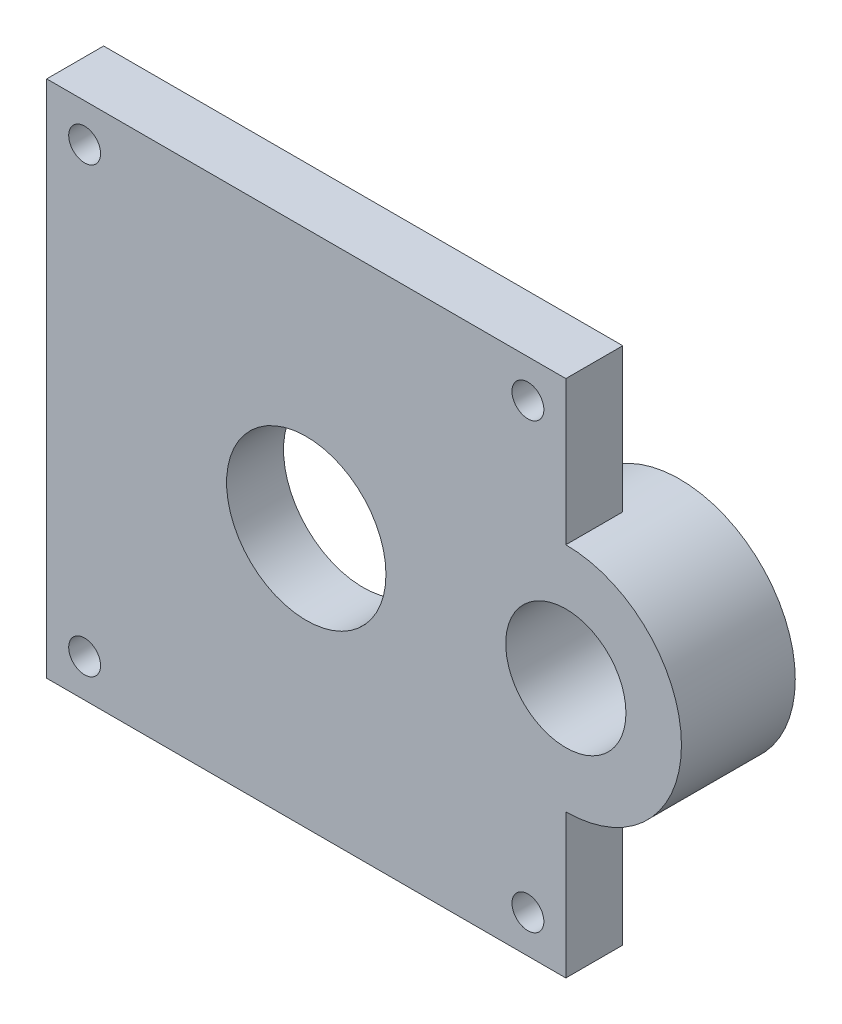
ISO-10303-21;
HEADER;
FILE_DESCRIPTION(('STEP AP214'),'2;1');
FILE_NAME('part.step','',(''),(''),'','','');
FILE_SCHEMA(('AUTOMOTIVE_DESIGN { 1 0 10303 214 1 1 1 1 }'));
ENDSEC;
DATA;
#1=APPLICATION_CONTEXT('core data for automotive mechanical design processes');
#2=APPLICATION_PROTOCOL_DEFINITION('international standard','automotive_design',2000,#1);
#3=PRODUCT_CONTEXT('',#1,'mechanical');
#4=PRODUCT('Part','Part','',(#3));
#5=PRODUCT_RELATED_PRODUCT_CATEGORY('part','',(#4));
#6=PRODUCT_DEFINITION_FORMATION('','',#4);
#7=PRODUCT_DEFINITION_CONTEXT('part definition',#1,'design');
#8=PRODUCT_DEFINITION('design','',#6,#7);
#9=PRODUCT_DEFINITION_SHAPE('','',#8);
#10=(LENGTH_UNIT() NAMED_UNIT(*) SI_UNIT(.MILLI.,.METRE.));
#11=(NAMED_UNIT(*) PLANE_ANGLE_UNIT() SI_UNIT($,.RADIAN.));
#12=(NAMED_UNIT(*) SI_UNIT($,.STERADIAN.) SOLID_ANGLE_UNIT());
#13=UNCERTAINTY_MEASURE_WITH_UNIT(LENGTH_MEASURE(1.E-05),#10,'distance_accuracy_value','');
#14=(GEOMETRIC_REPRESENTATION_CONTEXT(3) GLOBAL_UNCERTAINTY_ASSIGNED_CONTEXT((#13)) GLOBAL_UNIT_ASSIGNED_CONTEXT((#10,
#11,#12)) REPRESENTATION_CONTEXT('',''));
#15=CARTESIAN_POINT('',(0.,0.,0.));
#16=DIRECTION('',(0.,0.,1.));
#17=DIRECTION('',(1.,0.,0.));
#18=AXIS2_PLACEMENT_3D('',#15,#16,#17);
#19=CARTESIAN_POINT('',(28.956,0.,3.175));
#20=DIRECTION('',(-1.,0.,0.));
#21=DIRECTION('',(0.,0.,1.));
#22=AXIS2_PLACEMENT_3D('',#19,#20,#21);
#23=PLANE('',#22);
#24=DIRECTION('',(0.,1.,0.));
#25=VECTOR('',#24,1.);
#26=CARTESIAN_POINT('',(28.956,0.,0.));
#27=LINE('',#26,#25);
#28=CARTESIAN_POINT('',(28.956,0.,0.));
#29=VERTEX_POINT('',#28);
#30=CARTESIAN_POINT('',(28.956,8.02878125,0.));
#31=VERTEX_POINT('',#30);
#32=EDGE_CURVE('E107',#29,#31,#27,.T.);
#33=ORIENTED_EDGE('',*,*,#32,.T.);
#34=DIRECTION('',(0.,0.,1.));
#35=VECTOR('',#34,1.);
#36=CARTESIAN_POINT('',(28.956,8.02878125,-3.175));
#37=LINE('',#36,#35);
#38=CARTESIAN_POINT('',(28.956,8.02878125,3.175));
#39=VERTEX_POINT('',#38);
#40=EDGE_CURVE('E11',#31,#39,#37,.T.);
#41=ORIENTED_EDGE('',*,*,#40,.T.);
#42=DIRECTION('',(0.,1.,0.));
#43=VECTOR('',#42,1.);
#44=CARTESIAN_POINT('',(28.956,0.,3.175));
#45=LINE('',#44,#43);
#46=CARTESIAN_POINT('',(28.956,0.,3.175));
#47=VERTEX_POINT('',#46);
#48=EDGE_CURVE('E105',#47,#39,#45,.T.);
#49=ORIENTED_EDGE('',*,*,#48,.F.);
#50=DIRECTION('',(0.,0.,-1.));
#51=VECTOR('',#50,1.);
#52=CARTESIAN_POINT('',(28.956,0.,3.175));
#53=LINE('',#52,#51);
#54=EDGE_CURVE('E130',#47,#29,#53,.T.);
#55=ORIENTED_EDGE('',*,*,#54,.T.);
#56=EDGE_LOOP('',(#33,#41,#49,#55));
#57=FACE_BOUND('',#56,.T.);
#58=ADVANCED_FACE('F34',(#57),#23,.F.);
#59=CARTESIAN_POINT('',(0.,0.,3.175));
#60=DIRECTION('',(0.,0.,-1.));
#61=DIRECTION('',(-1.,0.,0.));
#62=AXIS2_PLACEMENT_3D('',#59,#60,#61);
#63=PLANE('',#62);
#64=CARTESIAN_POINT('',(28.956,14.478,3.175));
#65=DIRECTION('',(0.,0.,1.));
#66=DIRECTION('',(1.,0.,0.));
#67=AXIS2_PLACEMENT_3D('',#64,#65,#66);
#68=CIRCLE('',#67,3.3528);
#69=CARTESIAN_POINT('',(32.3088,14.478,3.175));
#70=VERTEX_POINT('',#69);
#71=EDGE_CURVE('E207',#70,#70,#68,.T.);
#72=ORIENTED_EDGE('',*,*,#71,.F.);
#73=EDGE_LOOP('',(#72));
#74=FACE_BOUND('',#73,.T.);
#75=CARTESIAN_POINT('',(2.11455,26.84145,3.175));
#76=DIRECTION('',(0.,0.,1.));
#77=DIRECTION('',(-1.,0.,0.));
#78=AXIS2_PLACEMENT_3D('',#75,#76,#77);
#79=CIRCLE('',#78,0.888999999999999);
#80=CARTESIAN_POINT('',(1.22555,26.84145,3.175));
#81=VERTEX_POINT('',#80);
#82=EDGE_CURVE('E214',#81,#81,#79,.T.);
#83=ORIENTED_EDGE('',*,*,#82,.F.);
#84=EDGE_LOOP('',(#83));
#85=FACE_BOUND('',#84,.T.);
#86=CARTESIAN_POINT('',(26.84145,26.84145,3.175));
#87=DIRECTION('',(0.,0.,1.));
#88=DIRECTION('',(1.,0.,0.));
#89=AXIS2_PLACEMENT_3D('',#86,#87,#88);
#90=CIRCLE('',#89,0.889000000000002);
#91=CARTESIAN_POINT('',(27.73045,26.84145,3.175));
#92=VERTEX_POINT('',#91);
#93=EDGE_CURVE('E225',#92,#92,#90,.T.);
#94=ORIENTED_EDGE('',*,*,#93,.F.);
#95=EDGE_LOOP('',(#94));
#96=FACE_BOUND('',#95,.T.);
#97=CARTESIAN_POINT('',(26.84145,2.11455,3.175));
#98=DIRECTION('',(0.,0.,1.));
#99=DIRECTION('',(-1.,0.,0.));
#100=AXIS2_PLACEMENT_3D('',#97,#98,#99);
#101=CIRCLE('',#100,0.889000000000003);
#102=CARTESIAN_POINT('',(25.95245,2.11455,3.175));
#103=VERTEX_POINT('',#102);
#104=EDGE_CURVE('E219',#103,#103,#101,.T.);
#105=ORIENTED_EDGE('',*,*,#104,.F.);
#106=EDGE_LOOP('',(#105));
#107=FACE_BOUND('',#106,.T.);
#108=CARTESIAN_POINT('',(2.11455,2.11455,3.175));
#109=DIRECTION('',(0.,0.,1.));
#110=DIRECTION('',(1.,0.,0.));
#111=AXIS2_PLACEMENT_3D('',#108,#109,#110);
#112=CIRCLE('',#111,0.889);
#113=CARTESIAN_POINT('',(3.00355,2.11455,3.175));
#114=VERTEX_POINT('',#113);
#115=EDGE_CURVE('E218',#114,#114,#112,.T.);
#116=ORIENTED_EDGE('',*,*,#115,.F.);
#117=EDGE_LOOP('',(#116));
#118=FACE_BOUND('',#117,.T.);
#119=ORIENTED_EDGE('',*,*,#48,.T.);
#120=CARTESIAN_POINT('',(28.956,14.478,3.175));
#121=DIRECTION('',(0.,0.,1.));
#122=DIRECTION('',(1.,0.,0.));
#123=AXIS2_PLACEMENT_3D('',#120,#121,#122);
#124=CIRCLE('',#123,6.44921875);
#125=CARTESIAN_POINT('',(28.956,20.92721875,3.175));
#126=VERTEX_POINT('',#125);
#127=EDGE_CURVE('E49',#39,#126,#124,.T.);
#128=ORIENTED_EDGE('',*,*,#127,.T.);
#129=CARTESIAN_POINT('',(28.956,28.956,3.175));
#130=VERTEX_POINT('',#129);
#131=EDGE_CURVE('E110',#126,#130,#45,.T.);
#132=ORIENTED_EDGE('',*,*,#131,.T.);
#133=DIRECTION('',(-1.,0.,0.));
#134=VECTOR('',#133,1.);
#135=CARTESIAN_POINT('',(0.,28.956,3.175));
#136=LINE('',#135,#134);
#137=CARTESIAN_POINT('',(0.,28.956,3.175));
#138=VERTEX_POINT('',#137);
#139=EDGE_CURVE('E56',#130,#138,#136,.T.);
#140=ORIENTED_EDGE('',*,*,#139,.T.);
#141=DIRECTION('',(0.,-1.,0.));
#142=VECTOR('',#141,1.);
#143=CARTESIAN_POINT('',(0.,0.,3.175));
#144=LINE('',#143,#142);
#145=CARTESIAN_POINT('',(0.,0.,3.175));
#146=VERTEX_POINT('',#145);
#147=EDGE_CURVE('E126',#138,#146,#144,.T.);
#148=ORIENTED_EDGE('',*,*,#147,.T.);
#149=DIRECTION('',(1.,0.,0.));
#150=VECTOR('',#149,1.);
#151=CARTESIAN_POINT('',(0.,0.,3.175));
#152=LINE('',#151,#150);
#153=EDGE_CURVE('E85',#146,#47,#152,.T.);
#154=ORIENTED_EDGE('',*,*,#153,.T.);
#155=EDGE_LOOP('',(#119,#128,#132,#140,#148,#154));
#156=FACE_BOUND('',#155,.T.);
#157=CARTESIAN_POINT('',(14.478,14.478,3.175));
#158=DIRECTION('',(0.,0.,1.));
#159=DIRECTION('',(1.,0.,0.));
#160=AXIS2_PLACEMENT_3D('',#157,#158,#159);
#161=CIRCLE('',#160,4.445);
#162=CARTESIAN_POINT('',(18.923,14.478,3.175));
#163=VERTEX_POINT('',#162);
#164=EDGE_CURVE('E121',#163,#163,#161,.T.);
#165=ORIENTED_EDGE('',*,*,#164,.F.);
#166=EDGE_LOOP('',(#165));
#167=FACE_BOUND('',#166,.T.);
#168=ADVANCED_FACE('F108',(#74,#85,#96,#107,#118,#156,#167),#63,.F.);
#169=CARTESIAN_POINT('',(0.,0.,0.));
#170=DIRECTION('',(0.,0.,-1.));
#171=DIRECTION('',(-1.,0.,0.));
#172=AXIS2_PLACEMENT_3D('',#169,#170,#171);
#173=PLANE('',#172);
#174=CARTESIAN_POINT('',(28.956,14.478,0.));
#175=DIRECTION('',(0.,0.,-1.));
#176=DIRECTION('',(-1.,0.,0.));
#177=AXIS2_PLACEMENT_3D('',#174,#175,#176);
#178=CIRCLE('',#177,6.44921875);
#179=CARTESIAN_POINT('',(28.956,20.92721875,0.));
#180=VERTEX_POINT('',#179);
#181=EDGE_CURVE('E140',#31,#180,#178,.T.);
#182=ORIENTED_EDGE('',*,*,#181,.F.);
#183=ORIENTED_EDGE('',*,*,#32,.F.);
#184=DIRECTION('',(1.,0.,0.));
#185=VECTOR('',#184,1.);
#186=CARTESIAN_POINT('',(0.,0.,0.));
#187=LINE('',#186,#185);
#188=CARTESIAN_POINT('',(0.,0.,0.));
#189=VERTEX_POINT('',#188);
#190=EDGE_CURVE('E120',#189,#29,#187,.T.);
#191=ORIENTED_EDGE('',*,*,#190,.F.);
#192=DIRECTION('',(0.,-1.,0.));
#193=VECTOR('',#192,1.);
#194=CARTESIAN_POINT('',(0.,0.,0.));
#195=LINE('',#194,#193);
#196=CARTESIAN_POINT('',(0.,28.956,0.));
#197=VERTEX_POINT('',#196);
#198=EDGE_CURVE('E117',#197,#189,#195,.T.);
#199=ORIENTED_EDGE('',*,*,#198,.F.);
#200=DIRECTION('',(-1.,0.,0.));
#201=VECTOR('',#200,1.);
#202=CARTESIAN_POINT('',(0.,28.956,0.));
#203=LINE('',#202,#201);
#204=CARTESIAN_POINT('',(28.956,28.956,0.));
#205=VERTEX_POINT('',#204);
#206=EDGE_CURVE('E77',#205,#197,#203,.T.);
#207=ORIENTED_EDGE('',*,*,#206,.F.);
#208=EDGE_CURVE('E123',#180,#205,#27,.T.);
#209=ORIENTED_EDGE('',*,*,#208,.F.);
#210=EDGE_LOOP('',(#182,#183,#191,#199,#207,#209));
#211=FACE_BOUND('',#210,.T.);
#212=CARTESIAN_POINT('',(2.11455,26.84145,0.));
#213=DIRECTION('',(0.,0.,1.));
#214=DIRECTION('',(-1.,0.,0.));
#215=AXIS2_PLACEMENT_3D('',#212,#213,#214);
#216=CIRCLE('',#215,0.888999999999999);
#217=CARTESIAN_POINT('',(1.22555,26.84145,0.));
#218=VERTEX_POINT('',#217);
#219=EDGE_CURVE('E228',#218,#218,#216,.T.);
#220=ORIENTED_EDGE('',*,*,#219,.T.);
#221=EDGE_LOOP('',(#220));
#222=FACE_BOUND('',#221,.T.);
#223=CARTESIAN_POINT('',(26.84145,26.84145,0.));
#224=DIRECTION('',(0.,0.,1.));
#225=DIRECTION('',(1.,0.,0.));
#226=AXIS2_PLACEMENT_3D('',#223,#224,#225);
#227=CIRCLE('',#226,0.889000000000002);
#228=CARTESIAN_POINT('',(27.73045,26.84145,0.));
#229=VERTEX_POINT('',#228);
#230=EDGE_CURVE('E222',#229,#229,#227,.T.);
#231=ORIENTED_EDGE('',*,*,#230,.T.);
#232=EDGE_LOOP('',(#231));
#233=FACE_BOUND('',#232,.T.);
#234=CARTESIAN_POINT('',(26.84145,2.11455,0.));
#235=DIRECTION('',(0.,0.,1.));
#236=DIRECTION('',(-1.,0.,0.));
#237=AXIS2_PLACEMENT_3D('',#234,#235,#236);
#238=CIRCLE('',#237,0.889000000000003);
#239=CARTESIAN_POINT('',(25.95245,2.11455,0.));
#240=VERTEX_POINT('',#239);
#241=EDGE_CURVE('E215',#240,#240,#238,.T.);
#242=ORIENTED_EDGE('',*,*,#241,.T.);
#243=EDGE_LOOP('',(#242));
#244=FACE_BOUND('',#243,.T.);
#245=CARTESIAN_POINT('',(2.11455,2.11455,0.));
#246=DIRECTION('',(0.,0.,1.));
#247=DIRECTION('',(1.,0.,0.));
#248=AXIS2_PLACEMENT_3D('',#245,#246,#247);
#249=CIRCLE('',#248,0.889);
#250=CARTESIAN_POINT('',(3.00355,2.11455,0.));
#251=VERTEX_POINT('',#250);
#252=EDGE_CURVE('E233',#251,#251,#249,.T.);
#253=ORIENTED_EDGE('',*,*,#252,.T.);
#254=EDGE_LOOP('',(#253));
#255=FACE_BOUND('',#254,.T.);
#256=CARTESIAN_POINT('',(14.478,14.478,0.));
#257=DIRECTION('',(0.,0.,1.));
#258=DIRECTION('',(1.,0.,0.));
#259=AXIS2_PLACEMENT_3D('',#256,#257,#258);
#260=CIRCLE('',#259,4.445);
#261=CARTESIAN_POINT('',(18.923,14.478,0.));
#262=VERTEX_POINT('',#261);
#263=EDGE_CURVE('E236',#262,#262,#260,.T.);
#264=ORIENTED_EDGE('',*,*,#263,.T.);
#265=EDGE_LOOP('',(#264));
#266=FACE_BOUND('',#265,.T.);
#267=ADVANCED_FACE('F138',(#211,#222,#233,#244,#255,#266),#173,.T.);
#268=CARTESIAN_POINT('',(0.,0.,3.175));
#269=DIRECTION('',(1.,0.,0.));
#270=DIRECTION('',(0.,0.,-1.));
#271=AXIS2_PLACEMENT_3D('',#268,#269,#270);
#272=PLANE('',#271);
#273=ORIENTED_EDGE('',*,*,#198,.T.);
#274=DIRECTION('',(0.,0.,-1.));
#275=VECTOR('',#274,1.);
#276=CARTESIAN_POINT('',(0.,0.,3.175));
#277=LINE('',#276,#275);
#278=EDGE_CURVE('E132',#146,#189,#277,.T.);
#279=ORIENTED_EDGE('',*,*,#278,.F.);
#280=ORIENTED_EDGE('',*,*,#147,.F.);
#281=DIRECTION('',(0.,0.,-1.));
#282=VECTOR('',#281,1.);
#283=CARTESIAN_POINT('',(0.,28.956,3.175));
#284=LINE('',#283,#282);
#285=EDGE_CURVE('E112',#138,#197,#284,.T.);
#286=ORIENTED_EDGE('',*,*,#285,.T.);
#287=EDGE_LOOP('',(#273,#279,#280,#286));
#288=FACE_BOUND('',#287,.T.);
#289=ADVANCED_FACE('F36',(#288),#272,.F.);
#290=CARTESIAN_POINT('',(0.,0.,3.175));
#291=DIRECTION('',(0.,1.,0.));
#292=DIRECTION('',(0.,0.,1.));
#293=AXIS2_PLACEMENT_3D('',#290,#291,#292);
#294=PLANE('',#293);
#295=ORIENTED_EDGE('',*,*,#190,.T.);
#296=ORIENTED_EDGE('',*,*,#54,.F.);
#297=ORIENTED_EDGE('',*,*,#153,.F.);
#298=ORIENTED_EDGE('',*,*,#278,.T.);
#299=EDGE_LOOP('',(#295,#296,#297,#298));
#300=FACE_BOUND('',#299,.T.);
#301=ADVANCED_FACE('F156',(#300),#294,.F.);
#302=ORIENTED_EDGE('',*,*,#131,.F.);
#303=DIRECTION('',(0.,0.,1.));
#304=VECTOR('',#303,1.);
#305=CARTESIAN_POINT('',(28.956,20.92721875,-3.175));
#306=LINE('',#305,#304);
#307=EDGE_CURVE('E42',#126,#180,#306,.F.);
#308=ORIENTED_EDGE('',*,*,#307,.T.);
#309=ORIENTED_EDGE('',*,*,#208,.T.);
#310=DIRECTION('',(0.,0.,-1.));
#311=VECTOR('',#310,1.);
#312=CARTESIAN_POINT('',(28.956,28.956,3.175));
#313=LINE('',#312,#311);
#314=EDGE_CURVE('E128',#130,#205,#313,.T.);
#315=ORIENTED_EDGE('',*,*,#314,.F.);
#316=EDGE_LOOP('',(#302,#308,#309,#315));
#317=FACE_BOUND('',#316,.T.);
#318=ADVANCED_FACE('F135',(#317),#23,.F.);
#319=CARTESIAN_POINT('',(0.,28.956,3.175));
#320=DIRECTION('',(0.,-1.,0.));
#321=DIRECTION('',(0.,0.,-1.));
#322=AXIS2_PLACEMENT_3D('',#319,#320,#321);
#323=PLANE('',#322);
#324=ORIENTED_EDGE('',*,*,#206,.T.);
#325=ORIENTED_EDGE('',*,*,#285,.F.);
#326=ORIENTED_EDGE('',*,*,#139,.F.);
#327=ORIENTED_EDGE('',*,*,#314,.T.);
#328=EDGE_LOOP('',(#324,#325,#326,#327));
#329=FACE_BOUND('',#328,.T.);
#330=ADVANCED_FACE('F145',(#329),#323,.F.);
#331=CARTESIAN_POINT('',(14.478,14.478,3.175));
#332=DIRECTION('',(0.,0.,-1.));
#333=DIRECTION('',(-1.,0.,0.));
#334=AXIS2_PLACEMENT_3D('',#331,#332,#333);
#335=CYLINDRICAL_SURFACE('',#334,4.445);
#336=ORIENTED_EDGE('',*,*,#164,.T.);
#337=EDGE_LOOP('',(#336));
#338=FACE_BOUND('',#337,.T.);
#339=ORIENTED_EDGE('',*,*,#263,.F.);
#340=EDGE_LOOP('',(#339));
#341=FACE_BOUND('',#340,.T.);
#342=ADVANCED_FACE('F147',(#338,#341),#335,.F.);
#343=CARTESIAN_POINT('',(2.11455,2.11455,0.));
#344=DIRECTION('',(0.,0.,1.));
#345=DIRECTION('',(1.,0.,0.));
#346=AXIS2_PLACEMENT_3D('',#343,#344,#345);
#347=CYLINDRICAL_SURFACE('',#346,0.889);
#348=ORIENTED_EDGE('',*,*,#252,.F.);
#349=EDGE_LOOP('',(#348));
#350=FACE_BOUND('',#349,.T.);
#351=ORIENTED_EDGE('',*,*,#115,.T.);
#352=EDGE_LOOP('',(#351));
#353=FACE_BOUND('',#352,.T.);
#354=ADVANCED_FACE('F153',(#350,#353),#347,.F.);
#355=CARTESIAN_POINT('',(26.84145,2.11455,0.));
#356=DIRECTION('',(0.,0.,1.));
#357=DIRECTION('',(1.,0.,0.));
#358=AXIS2_PLACEMENT_3D('',#355,#356,#357);
#359=CYLINDRICAL_SURFACE('',#358,0.889000000000003);
#360=ORIENTED_EDGE('',*,*,#241,.F.);
#361=EDGE_LOOP('',(#360));
#362=FACE_BOUND('',#361,.T.);
#363=ORIENTED_EDGE('',*,*,#104,.T.);
#364=EDGE_LOOP('',(#363));
#365=FACE_BOUND('',#364,.T.);
#366=ADVANCED_FACE('F177',(#362,#365),#359,.F.);
#367=CARTESIAN_POINT('',(26.84145,26.84145,0.));
#368=DIRECTION('',(0.,0.,1.));
#369=DIRECTION('',(1.,0.,0.));
#370=AXIS2_PLACEMENT_3D('',#367,#368,#369);
#371=CYLINDRICAL_SURFACE('',#370,0.889000000000002);
#372=ORIENTED_EDGE('',*,*,#230,.F.);
#373=EDGE_LOOP('',(#372));
#374=FACE_BOUND('',#373,.T.);
#375=ORIENTED_EDGE('',*,*,#93,.T.);
#376=EDGE_LOOP('',(#375));
#377=FACE_BOUND('',#376,.T.);
#378=ADVANCED_FACE('F182',(#374,#377),#371,.F.);
#379=CARTESIAN_POINT('',(2.11455,26.84145,0.));
#380=DIRECTION('',(0.,0.,1.));
#381=DIRECTION('',(1.,0.,0.));
#382=AXIS2_PLACEMENT_3D('',#379,#380,#381);
#383=CYLINDRICAL_SURFACE('',#382,0.888999999999999);
#384=ORIENTED_EDGE('',*,*,#219,.F.);
#385=EDGE_LOOP('',(#384));
#386=FACE_BOUND('',#385,.T.);
#387=ORIENTED_EDGE('',*,*,#82,.T.);
#388=EDGE_LOOP('',(#387));
#389=FACE_BOUND('',#388,.T.);
#390=ADVANCED_FACE('F179',(#386,#389),#383,.F.);
#391=CARTESIAN_POINT('',(28.956,14.478,-3.175));
#392=DIRECTION('',(0.,0.,1.));
#393=DIRECTION('',(1.,0.,0.));
#394=AXIS2_PLACEMENT_3D('',#391,#392,#393);
#395=CYLINDRICAL_SURFACE('',#394,6.44921875);
#396=CARTESIAN_POINT('',(28.956,14.478,-3.175));
#397=DIRECTION('',(0.,0.,1.));
#398=DIRECTION('',(1.,0.,0.));
#399=AXIS2_PLACEMENT_3D('',#396,#397,#398);
#400=CIRCLE('',#399,6.44921875);
#401=CARTESIAN_POINT('',(35.40521875,14.478,-3.175));
#402=VERTEX_POINT('',#401);
#403=EDGE_CURVE('E98',#402,#402,#400,.T.);
#404=ORIENTED_EDGE('',*,*,#403,.T.);
#405=EDGE_LOOP('',(#404));
#406=FACE_BOUND('',#405,.T.);
#407=ORIENTED_EDGE('',*,*,#40,.F.);
#408=ORIENTED_EDGE('',*,*,#181,.T.);
#409=ORIENTED_EDGE('',*,*,#307,.F.);
#410=ORIENTED_EDGE('',*,*,#127,.F.);
#411=EDGE_LOOP('',(#407,#408,#409,#410));
#412=FACE_BOUND('',#411,.T.);
#413=ADVANCED_FACE('F94',(#406,#412),#395,.T.);
#414=CARTESIAN_POINT('',(28.956,14.478,-3.175));
#415=DIRECTION('',(0.,0.,1.));
#416=DIRECTION('',(1.,0.,0.));
#417=AXIS2_PLACEMENT_3D('',#414,#415,#416);
#418=PLANE('',#417);
#419=CARTESIAN_POINT('',(28.956,14.478,-3.175));
#420=DIRECTION('',(0.,0.,1.));
#421=DIRECTION('',(1.,0.,0.));
#422=AXIS2_PLACEMENT_3D('',#419,#420,#421);
#423=CIRCLE('',#422,3.3528);
#424=CARTESIAN_POINT('',(32.3088,14.478,-3.175));
#425=VERTEX_POINT('',#424);
#426=EDGE_CURVE('E99',#425,#425,#423,.T.);
#427=ORIENTED_EDGE('',*,*,#426,.T.);
#428=EDGE_LOOP('',(#427));
#429=FACE_BOUND('',#428,.T.);
#430=ORIENTED_EDGE('',*,*,#403,.F.);
#431=EDGE_LOOP('',(#430));
#432=FACE_BOUND('',#431,.T.);
#433=ADVANCED_FACE('F192',(#429,#432),#418,.F.);
#434=CARTESIAN_POINT('',(28.956,14.478,-3.175));
#435=DIRECTION('',(0.,0.,1.));
#436=DIRECTION('',(1.,0.,0.));
#437=AXIS2_PLACEMENT_3D('',#434,#435,#436);
#438=CYLINDRICAL_SURFACE('',#437,3.3528);
#439=ORIENTED_EDGE('',*,*,#426,.F.);
#440=EDGE_LOOP('',(#439));
#441=FACE_BOUND('',#440,.T.);
#442=ORIENTED_EDGE('',*,*,#71,.T.);
#443=EDGE_LOOP('',(#442));
#444=FACE_BOUND('',#443,.T.);
#445=ADVANCED_FACE('F196',(#441,#444),#438,.F.);
#446=CLOSED_SHELL('',(#58,#168,#267,#289,#301,#318,#330,#342,#354,#366,#378,#390,#413,#433,#445));
#447=MANIFOLD_SOLID_BREP('B2',#446);
#448=ADVANCED_BREP_SHAPE_REPRESENTATION('',(#18,#447),#14);
#449=SHAPE_DEFINITION_REPRESENTATION(#9,#448);
ENDSEC;
END-ISO-10303-21;
